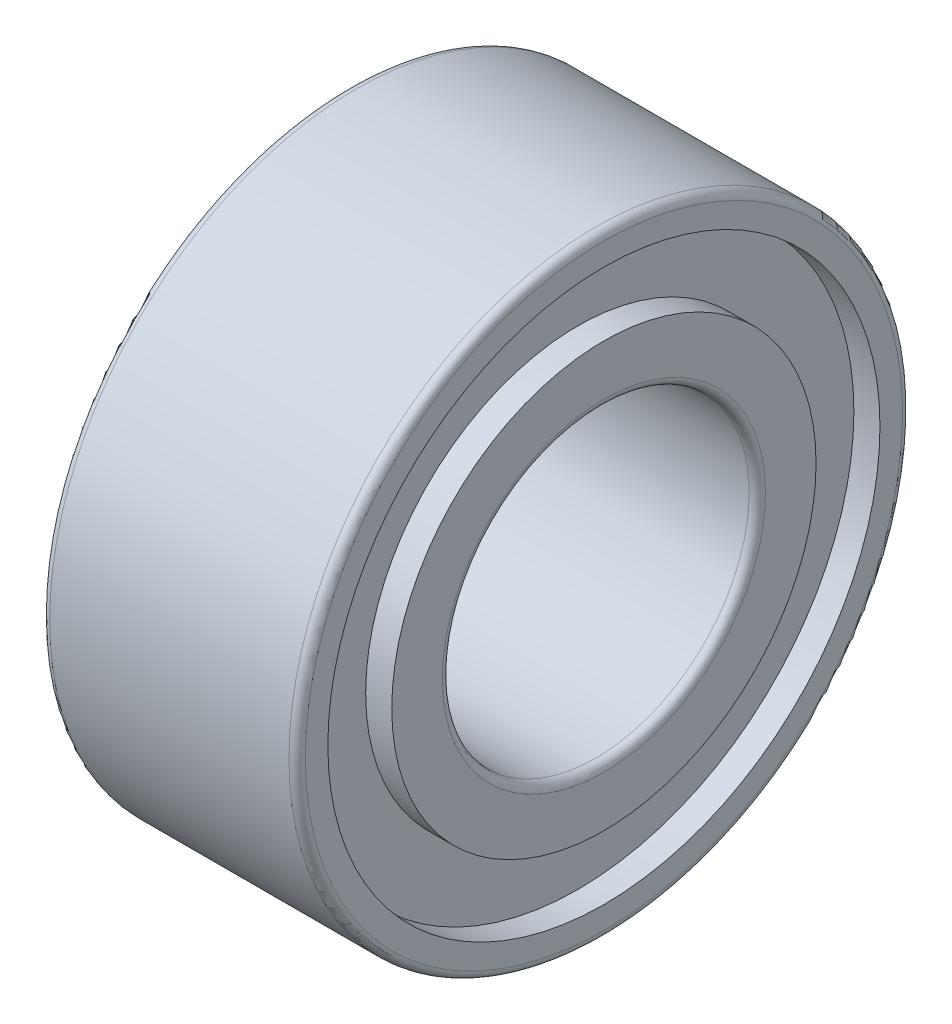
ISO-10303-21;
HEADER;
FILE_DESCRIPTION(('STEP AP214'),'2;1');
FILE_NAME('part.step','',(''),(''),'','','');
FILE_SCHEMA(('AUTOMOTIVE_DESIGN { 1 0 10303 214 1 1 1 1 }'));
ENDSEC;
DATA;
#1=APPLICATION_CONTEXT('core data for automotive mechanical design processes');
#2=APPLICATION_PROTOCOL_DEFINITION('international standard','automotive_design',2000,#1);
#3=PRODUCT_CONTEXT('',#1,'mechanical');
#4=PRODUCT('Part','Part','',(#3));
#5=PRODUCT_RELATED_PRODUCT_CATEGORY('part','',(#4));
#6=PRODUCT_DEFINITION_FORMATION('','',#4);
#7=PRODUCT_DEFINITION_CONTEXT('part definition',#1,'design');
#8=PRODUCT_DEFINITION('design','',#6,#7);
#9=PRODUCT_DEFINITION_SHAPE('','',#8);
#10=(LENGTH_UNIT() NAMED_UNIT(*) SI_UNIT(.MILLI.,.METRE.));
#11=(NAMED_UNIT(*) PLANE_ANGLE_UNIT() SI_UNIT($,.RADIAN.));
#12=(NAMED_UNIT(*) SI_UNIT($,.STERADIAN.) SOLID_ANGLE_UNIT());
#13=UNCERTAINTY_MEASURE_WITH_UNIT(LENGTH_MEASURE(1.E-05),#10,'distance_accuracy_value','');
#14=(GEOMETRIC_REPRESENTATION_CONTEXT(3) GLOBAL_UNCERTAINTY_ASSIGNED_CONTEXT((#13)) GLOBAL_UNIT_ASSIGNED_CONTEXT((#10,
#11,#12)) REPRESENTATION_CONTEXT('',''));
#15=CARTESIAN_POINT('',(0.,0.,0.));
#16=DIRECTION('',(0.,0.,1.));
#17=DIRECTION('',(1.,0.,0.));
#18=AXIS2_PLACEMENT_3D('',#15,#16,#17);
#19=CARTESIAN_POINT('',(0.,1.58,0.));
#20=DIRECTION('',(-1.,0.,0.));
#21=DIRECTION('',(0.,0.,1.));
#22=AXIS2_PLACEMENT_3D('',#19,#20,#21);
#23=PLANE('',#22);
#24=CARTESIAN_POINT('',(0.,0.,0.));
#25=DIRECTION('',(-1.,0.,0.));
#26=DIRECTION('',(0.,0.,1.));
#27=AXIS2_PLACEMENT_3D('',#24,#25,#26);
#28=CIRCLE('',#27,2.075);
#29=CARTESIAN_POINT('',(0.,0.,2.075));
#30=VERTEX_POINT('',#29);
#31=EDGE_CURVE('E10',#30,#30,#28,.T.);
#32=ORIENTED_EDGE('',*,*,#31,.T.);
#33=EDGE_LOOP('',(#32));
#34=FACE_BOUND('',#33,.T.);
#35=CARTESIAN_POINT('',(0.,0.,0.));
#36=DIRECTION('',(-1.,0.,0.));
#37=DIRECTION('',(0.,0.,1.));
#38=AXIS2_PLACEMENT_3D('',#35,#36,#37);
#39=CIRCLE('',#38,1.58);
#40=CARTESIAN_POINT('',(0.,0.,1.58));
#41=VERTEX_POINT('',#40);
#42=EDGE_CURVE('E108',#41,#41,#39,.T.);
#43=ORIENTED_EDGE('',*,*,#42,.F.);
#44=EDGE_LOOP('',(#43));
#45=FACE_BOUND('',#44,.T.);
#46=ADVANCED_FACE('F41',(#34,#45),#23,.T.);
#47=CARTESIAN_POINT('',(2.5,0.,0.));
#48=DIRECTION('',(-1.,0.,0.));
#49=DIRECTION('',(0.,0.,1.));
#50=AXIS2_PLACEMENT_3D('',#47,#48,#49);
#51=CYLINDRICAL_SURFACE('',#50,2.075);
#52=CARTESIAN_POINT('',(0.255,0.,0.));
#53=DIRECTION('',(-1.,0.,0.));
#54=DIRECTION('',(0.,0.,1.));
#55=AXIS2_PLACEMENT_3D('',#52,#53,#54);
#56=CIRCLE('',#55,2.075);
#57=CARTESIAN_POINT('',(0.255,0.,2.075));
#58=VERTEX_POINT('',#57);
#59=EDGE_CURVE('E48',#58,#58,#56,.T.);
#60=ORIENTED_EDGE('',*,*,#59,.T.);
#61=EDGE_LOOP('',(#60));
#62=FACE_BOUND('',#61,.T.);
#63=ORIENTED_EDGE('',*,*,#31,.F.);
#64=EDGE_LOOP('',(#63));
#65=FACE_BOUND('',#64,.T.);
#66=ADVANCED_FACE('F117',(#62,#65),#51,.T.);
#67=CARTESIAN_POINT('',(0.255,2.075,0.));
#68=DIRECTION('',(-1.,0.,0.));
#69=DIRECTION('',(0.,0.,1.));
#70=AXIS2_PLACEMENT_3D('',#67,#68,#69);
#71=PLANE('',#70);
#72=CARTESIAN_POINT('',(0.255,0.,0.));
#73=DIRECTION('',(-1.,0.,0.));
#74=DIRECTION('',(0.,0.,1.));
#75=AXIS2_PLACEMENT_3D('',#72,#73,#74);
#76=CIRCLE('',#75,2.7);
#77=CARTESIAN_POINT('',(0.255,0.,2.7));
#78=VERTEX_POINT('',#77);
#79=EDGE_CURVE('E53',#78,#78,#76,.T.);
#80=ORIENTED_EDGE('',*,*,#79,.T.);
#81=EDGE_LOOP('',(#80));
#82=FACE_BOUND('',#81,.T.);
#83=ORIENTED_EDGE('',*,*,#59,.F.);
#84=EDGE_LOOP('',(#83));
#85=FACE_BOUND('',#84,.T.);
#86=ADVANCED_FACE('F121',(#82,#85),#71,.T.);
#87=CARTESIAN_POINT('',(2.5,0.,0.));
#88=DIRECTION('',(-1.,0.,0.));
#89=DIRECTION('',(0.,0.,1.));
#90=AXIS2_PLACEMENT_3D('',#87,#88,#89);
#91=CYLINDRICAL_SURFACE('',#90,2.7);
#92=CARTESIAN_POINT('',(0.,0.,0.));
#93=DIRECTION('',(-1.,0.,0.));
#94=DIRECTION('',(0.,0.,1.));
#95=AXIS2_PLACEMENT_3D('',#92,#93,#94);
#96=CIRCLE('',#95,2.7);
#97=CARTESIAN_POINT('',(0.,0.,2.7));
#98=VERTEX_POINT('',#97);
#99=EDGE_CURVE('E58',#98,#98,#96,.T.);
#100=ORIENTED_EDGE('',*,*,#99,.T.);
#101=EDGE_LOOP('',(#100));
#102=FACE_BOUND('',#101,.T.);
#103=ORIENTED_EDGE('',*,*,#79,.F.);
#104=EDGE_LOOP('',(#103));
#105=FACE_BOUND('',#104,.T.);
#106=ADVANCED_FACE('F125',(#102,#105),#91,.F.);
#107=CARTESIAN_POINT('',(0.,2.7,0.));
#108=DIRECTION('',(-1.,0.,0.));
#109=DIRECTION('',(0.,0.,1.));
#110=AXIS2_PLACEMENT_3D('',#107,#108,#109);
#111=PLANE('',#110);
#112=CARTESIAN_POINT('',(0.,0.,0.));
#113=DIRECTION('',(-1.,0.,0.));
#114=DIRECTION('',(0.,0.,1.));
#115=AXIS2_PLACEMENT_3D('',#112,#113,#114);
#116=CIRCLE('',#115,2.92);
#117=CARTESIAN_POINT('',(0.,0.,2.92));
#118=VERTEX_POINT('',#117);
#119=EDGE_CURVE('E64',#118,#118,#116,.T.);
#120=ORIENTED_EDGE('',*,*,#119,.T.);
#121=EDGE_LOOP('',(#120));
#122=FACE_BOUND('',#121,.T.);
#123=ORIENTED_EDGE('',*,*,#99,.F.);
#124=EDGE_LOOP('',(#123));
#125=FACE_BOUND('',#124,.T.);
#126=ADVANCED_FACE('F132',(#122,#125),#111,.T.);
#127=CARTESIAN_POINT('',(0.08,0.,0.));
#128=DIRECTION('',(-1.,0.,0.));
#129=DIRECTION('',(0.,0.,1.));
#130=AXIS2_PLACEMENT_3D('',#127,#128,#129);
#131=TOROIDAL_SURFACE('',#130,2.92,0.0800000000000001);
#132=CARTESIAN_POINT('',(0.0800000000000002,0.,0.));
#133=DIRECTION('',(-1.,0.,0.));
#134=DIRECTION('',(0.,0.,1.));
#135=AXIS2_PLACEMENT_3D('',#132,#133,#134);
#136=CIRCLE('',#135,3.);
#137=CARTESIAN_POINT('',(0.0800000000000002,0.,3.));
#138=VERTEX_POINT('',#137);
#139=EDGE_CURVE('E68',#138,#138,#136,.T.);
#140=ORIENTED_EDGE('',*,*,#139,.T.);
#141=EDGE_LOOP('',(#140));
#142=FACE_BOUND('',#141,.T.);
#143=ORIENTED_EDGE('',*,*,#119,.F.);
#144=EDGE_LOOP('',(#143));
#145=FACE_BOUND('',#144,.T.);
#146=ADVANCED_FACE('F136',(#142,#145),#131,.T.);
#147=CARTESIAN_POINT('',(2.5,0.,0.));
#148=DIRECTION('',(-1.,0.,0.));
#149=DIRECTION('',(0.,0.,1.));
#150=AXIS2_PLACEMENT_3D('',#147,#148,#149);
#151=CYLINDRICAL_SURFACE('',#150,3.);
#152=CARTESIAN_POINT('',(2.42,0.,0.));
#153=DIRECTION('',(-1.,0.,0.));
#154=DIRECTION('',(0.,0.,1.));
#155=AXIS2_PLACEMENT_3D('',#152,#153,#154);
#156=CIRCLE('',#155,3.);
#157=CARTESIAN_POINT('',(2.42,0.,3.));
#158=VERTEX_POINT('',#157);
#159=EDGE_CURVE('E72',#158,#158,#156,.T.);
#160=ORIENTED_EDGE('',*,*,#159,.T.);
#161=EDGE_LOOP('',(#160));
#162=FACE_BOUND('',#161,.T.);
#163=ORIENTED_EDGE('',*,*,#139,.F.);
#164=EDGE_LOOP('',(#163));
#165=FACE_BOUND('',#164,.T.);
#166=ADVANCED_FACE('F140',(#162,#165),#151,.T.);
#167=CARTESIAN_POINT('',(2.42,0.,0.));
#168=DIRECTION('',(-1.,0.,0.));
#169=DIRECTION('',(0.,0.,1.));
#170=AXIS2_PLACEMENT_3D('',#167,#168,#169);
#171=TOROIDAL_SURFACE('',#170,2.92,0.0800000000000002);
#172=CARTESIAN_POINT('',(2.5,0.,0.));
#173=DIRECTION('',(-1.,0.,0.));
#174=DIRECTION('',(0.,0.,1.));
#175=AXIS2_PLACEMENT_3D('',#172,#173,#174);
#176=CIRCLE('',#175,2.92);
#177=CARTESIAN_POINT('',(2.5,0.,2.92));
#178=VERTEX_POINT('',#177);
#179=EDGE_CURVE('E76',#178,#178,#176,.T.);
#180=ORIENTED_EDGE('',*,*,#179,.T.);
#181=EDGE_LOOP('',(#180));
#182=FACE_BOUND('',#181,.T.);
#183=ORIENTED_EDGE('',*,*,#159,.F.);
#184=EDGE_LOOP('',(#183));
#185=FACE_BOUND('',#184,.T.);
#186=ADVANCED_FACE('F144',(#182,#185),#171,.T.);
#187=CARTESIAN_POINT('',(2.5,2.92,0.));
#188=DIRECTION('',(1.,0.,0.));
#189=DIRECTION('',(0.,0.,-1.));
#190=AXIS2_PLACEMENT_3D('',#187,#188,#189);
#191=PLANE('',#190);
#192=CARTESIAN_POINT('',(2.5,0.,0.));
#193=DIRECTION('',(-1.,0.,0.));
#194=DIRECTION('',(0.,0.,1.));
#195=AXIS2_PLACEMENT_3D('',#192,#193,#194);
#196=CIRCLE('',#195,2.7);
#197=CARTESIAN_POINT('',(2.5,0.,2.7));
#198=VERTEX_POINT('',#197);
#199=EDGE_CURVE('E80',#198,#198,#196,.T.);
#200=ORIENTED_EDGE('',*,*,#199,.T.);
#201=EDGE_LOOP('',(#200));
#202=FACE_BOUND('',#201,.T.);
#203=ORIENTED_EDGE('',*,*,#179,.F.);
#204=EDGE_LOOP('',(#203));
#205=FACE_BOUND('',#204,.T.);
#206=ADVANCED_FACE('F148',(#202,#205),#191,.T.);
#207=CARTESIAN_POINT('',(2.5,0.,0.));
#208=DIRECTION('',(-1.,0.,0.));
#209=DIRECTION('',(0.,0.,1.));
#210=AXIS2_PLACEMENT_3D('',#207,#208,#209);
#211=CYLINDRICAL_SURFACE('',#210,2.7);
#212=CARTESIAN_POINT('',(2.245,0.,0.));
#213=DIRECTION('',(-1.,0.,0.));
#214=DIRECTION('',(0.,0.,1.));
#215=AXIS2_PLACEMENT_3D('',#212,#213,#214);
#216=CIRCLE('',#215,2.7);
#217=CARTESIAN_POINT('',(2.245,0.,2.7));
#218=VERTEX_POINT('',#217);
#219=EDGE_CURVE('E84',#218,#218,#216,.T.);
#220=ORIENTED_EDGE('',*,*,#219,.T.);
#221=EDGE_LOOP('',(#220));
#222=FACE_BOUND('',#221,.T.);
#223=ORIENTED_EDGE('',*,*,#199,.F.);
#224=EDGE_LOOP('',(#223));
#225=FACE_BOUND('',#224,.T.);
#226=ADVANCED_FACE('F152',(#222,#225),#211,.F.);
#227=CARTESIAN_POINT('',(2.245,2.7,0.));
#228=DIRECTION('',(1.,0.,0.));
#229=DIRECTION('',(0.,0.,-1.));
#230=AXIS2_PLACEMENT_3D('',#227,#228,#229);
#231=PLANE('',#230);
#232=CARTESIAN_POINT('',(2.245,0.,0.));
#233=DIRECTION('',(-1.,0.,0.));
#234=DIRECTION('',(0.,0.,1.));
#235=AXIS2_PLACEMENT_3D('',#232,#233,#234);
#236=CIRCLE('',#235,2.075);
#237=CARTESIAN_POINT('',(2.245,0.,2.075));
#238=VERTEX_POINT('',#237);
#239=EDGE_CURVE('E88',#238,#238,#236,.T.);
#240=ORIENTED_EDGE('',*,*,#239,.T.);
#241=EDGE_LOOP('',(#240));
#242=FACE_BOUND('',#241,.T.);
#243=ORIENTED_EDGE('',*,*,#219,.F.);
#244=EDGE_LOOP('',(#243));
#245=FACE_BOUND('',#244,.T.);
#246=ADVANCED_FACE('F156',(#242,#245),#231,.T.);
#247=CARTESIAN_POINT('',(2.5,0.,0.));
#248=DIRECTION('',(-1.,0.,0.));
#249=DIRECTION('',(0.,0.,1.));
#250=AXIS2_PLACEMENT_3D('',#247,#248,#249);
#251=CYLINDRICAL_SURFACE('',#250,2.075);
#252=CARTESIAN_POINT('',(2.5,0.,0.));
#253=DIRECTION('',(-1.,0.,0.));
#254=DIRECTION('',(0.,0.,1.));
#255=AXIS2_PLACEMENT_3D('',#252,#253,#254);
#256=CIRCLE('',#255,2.075);
#257=CARTESIAN_POINT('',(2.5,0.,2.075));
#258=VERTEX_POINT('',#257);
#259=EDGE_CURVE('E92',#258,#258,#256,.T.);
#260=ORIENTED_EDGE('',*,*,#259,.T.);
#261=EDGE_LOOP('',(#260));
#262=FACE_BOUND('',#261,.T.);
#263=ORIENTED_EDGE('',*,*,#239,.F.);
#264=EDGE_LOOP('',(#263));
#265=FACE_BOUND('',#264,.T.);
#266=ADVANCED_FACE('F160',(#262,#265),#251,.T.);
#267=CARTESIAN_POINT('',(2.5,2.075,0.));
#268=DIRECTION('',(1.,0.,0.));
#269=DIRECTION('',(0.,0.,-1.));
#270=AXIS2_PLACEMENT_3D('',#267,#268,#269);
#271=PLANE('',#270);
#272=CARTESIAN_POINT('',(2.5,0.,0.));
#273=DIRECTION('',(-1.,0.,0.));
#274=DIRECTION('',(0.,0.,1.));
#275=AXIS2_PLACEMENT_3D('',#272,#273,#274);
#276=CIRCLE('',#275,1.58);
#277=CARTESIAN_POINT('',(2.5,0.,1.58));
#278=VERTEX_POINT('',#277);
#279=EDGE_CURVE('E96',#278,#278,#276,.T.);
#280=ORIENTED_EDGE('',*,*,#279,.T.);
#281=EDGE_LOOP('',(#280));
#282=FACE_BOUND('',#281,.T.);
#283=ORIENTED_EDGE('',*,*,#259,.F.);
#284=EDGE_LOOP('',(#283));
#285=FACE_BOUND('',#284,.T.);
#286=ADVANCED_FACE('F164',(#282,#285),#271,.T.);
#287=CARTESIAN_POINT('',(2.42,0.,0.));
#288=DIRECTION('',(-1.,0.,0.));
#289=DIRECTION('',(0.,0.,1.));
#290=AXIS2_PLACEMENT_3D('',#287,#288,#289);
#291=TOROIDAL_SURFACE('',#290,1.58,0.0800000000000001);
#292=CARTESIAN_POINT('',(2.42,0.,0.));
#293=DIRECTION('',(-1.,0.,0.));
#294=DIRECTION('',(0.,0.,1.));
#295=AXIS2_PLACEMENT_3D('',#292,#293,#294);
#296=CIRCLE('',#295,1.5);
#297=CARTESIAN_POINT('',(2.42,0.,1.5));
#298=VERTEX_POINT('',#297);
#299=EDGE_CURVE('E100',#298,#298,#296,.T.);
#300=ORIENTED_EDGE('',*,*,#299,.T.);
#301=EDGE_LOOP('',(#300));
#302=FACE_BOUND('',#301,.T.);
#303=ORIENTED_EDGE('',*,*,#279,.F.);
#304=EDGE_LOOP('',(#303));
#305=FACE_BOUND('',#304,.T.);
#306=ADVANCED_FACE('F168',(#302,#305),#291,.T.);
#307=CARTESIAN_POINT('',(2.5,0.,0.));
#308=DIRECTION('',(-1.,0.,0.));
#309=DIRECTION('',(0.,0.,1.));
#310=AXIS2_PLACEMENT_3D('',#307,#308,#309);
#311=CYLINDRICAL_SURFACE('',#310,1.5);
#312=CARTESIAN_POINT('',(0.0800000000000002,0.,0.));
#313=DIRECTION('',(-1.,0.,0.));
#314=DIRECTION('',(0.,0.,1.));
#315=AXIS2_PLACEMENT_3D('',#312,#313,#314);
#316=CIRCLE('',#315,1.5);
#317=CARTESIAN_POINT('',(0.0800000000000002,0.,1.5));
#318=VERTEX_POINT('',#317);
#319=EDGE_CURVE('E104',#318,#318,#316,.T.);
#320=ORIENTED_EDGE('',*,*,#319,.T.);
#321=EDGE_LOOP('',(#320));
#322=FACE_BOUND('',#321,.T.);
#323=ORIENTED_EDGE('',*,*,#299,.F.);
#324=EDGE_LOOP('',(#323));
#325=FACE_BOUND('',#324,.T.);
#326=ADVANCED_FACE('F172',(#322,#325),#311,.F.);
#327=CARTESIAN_POINT('',(0.08,0.,0.));
#328=DIRECTION('',(-1.,0.,0.));
#329=DIRECTION('',(0.,0.,1.));
#330=AXIS2_PLACEMENT_3D('',#327,#328,#329);
#331=TOROIDAL_SURFACE('',#330,1.58,0.08);
#332=ORIENTED_EDGE('',*,*,#42,.T.);
#333=EDGE_LOOP('',(#332));
#334=FACE_BOUND('',#333,.T.);
#335=ORIENTED_EDGE('',*,*,#319,.F.);
#336=EDGE_LOOP('',(#335));
#337=FACE_BOUND('',#336,.T.);
#338=ADVANCED_FACE('F113',(#334,#337),#331,.T.);
#339=CLOSED_SHELL('',(#46,#66,#86,#106,#126,#146,#166,#186,#206,#226,#246,#266,#286,#306,#326,#338));
#340=MANIFOLD_SOLID_BREP('B2',#339);
#341=ADVANCED_BREP_SHAPE_REPRESENTATION('',(#18,#340),#14);
#342=SHAPE_DEFINITION_REPRESENTATION(#9,#341);
ENDSEC;
END-ISO-10303-21;
